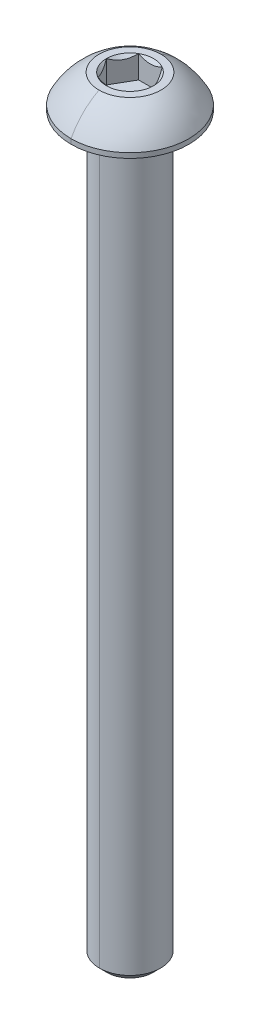
ISO-10303-21;
HEADER;
FILE_DESCRIPTION(('STEP AP214'),'2;1');
FILE_NAME('part.step','',(''),(''),'','','');
FILE_SCHEMA(('AUTOMOTIVE_DESIGN { 1 0 10303 214 1 1 1 1 }'));
ENDSEC;
DATA;
#1=APPLICATION_CONTEXT('core data for automotive mechanical design processes');
#2=APPLICATION_PROTOCOL_DEFINITION('international standard','automotive_design',2000,#1);
#3=PRODUCT_CONTEXT('',#1,'mechanical');
#4=PRODUCT('Part','Part','',(#3));
#5=PRODUCT_RELATED_PRODUCT_CATEGORY('part','',(#4));
#6=PRODUCT_DEFINITION_FORMATION('','',#4);
#7=PRODUCT_DEFINITION_CONTEXT('part definition',#1,'design');
#8=PRODUCT_DEFINITION('design','',#6,#7);
#9=PRODUCT_DEFINITION_SHAPE('','',#8);
#10=(LENGTH_UNIT() NAMED_UNIT(*) SI_UNIT(.MILLI.,.METRE.));
#11=(NAMED_UNIT(*) PLANE_ANGLE_UNIT() SI_UNIT($,.RADIAN.));
#12=(NAMED_UNIT(*) SI_UNIT($,.STERADIAN.) SOLID_ANGLE_UNIT());
#13=UNCERTAINTY_MEASURE_WITH_UNIT(LENGTH_MEASURE(1.E-05),#10,'distance_accuracy_value','');
#14=(GEOMETRIC_REPRESENTATION_CONTEXT(3) GLOBAL_UNCERTAINTY_ASSIGNED_CONTEXT((#13)) GLOBAL_UNIT_ASSIGNED_CONTEXT((#10,
#11,#12)) REPRESENTATION_CONTEXT('',''));
#15=CARTESIAN_POINT('',(0.,0.,0.));
#16=DIRECTION('',(0.,0.,1.));
#17=DIRECTION('',(1.,0.,0.));
#18=AXIS2_PLACEMENT_3D('',#15,#16,#17);
#19=CARTESIAN_POINT('',(0.,-0.152399999999997,0.));
#20=DIRECTION('',(0.,1.,0.));
#21=DIRECTION('',(0.,0.,1.));
#22=AXIS2_PLACEMENT_3D('',#19,#20,#21);
#23=TOROIDAL_SURFACE('',#22,2.5273,0.1524);
#24=CARTESIAN_POINT('',(0.,-0.152399999999997,-2.5273));
#25=DIRECTION('',(1.,0.,0.));
#26=DIRECTION('',(0.,0.,-1.));
#27=AXIS2_PLACEMENT_3D('',#24,#25,#26);
#28=CIRCLE('',#27,0.1524);
#29=CARTESIAN_POINT('',(0.,0.,-2.5273));
#30=VERTEX_POINT('',#29);
#31=CARTESIAN_POINT('',(0.,-0.152399999999997,-2.3749));
#32=VERTEX_POINT('',#31);
#33=EDGE_CURVE('E605',#30,#32,#28,.T.);
#34=ORIENTED_EDGE('',*,*,#33,.F.);
#35=CARTESIAN_POINT('',(0.,0.,0.));
#36=DIRECTION('',(0.,1.,0.));
#37=DIRECTION('',(0.,0.,1.));
#38=AXIS2_PLACEMENT_3D('',#35,#36,#37);
#39=CIRCLE('',#38,2.5273);
#40=CARTESIAN_POINT('',(0.,0.,2.5273));
#41=VERTEX_POINT('',#40);
#42=EDGE_CURVE('E170',#41,#30,#39,.T.);
#43=ORIENTED_EDGE('',*,*,#42,.F.);
#44=CARTESIAN_POINT('',(0.,-0.152399999999997,2.5273));
#45=DIRECTION('',(-1.,0.,0.));
#46=DIRECTION('',(0.,0.,1.));
#47=AXIS2_PLACEMENT_3D('',#44,#45,#46);
#48=CIRCLE('',#47,0.1524);
#49=CARTESIAN_POINT('',(0.,-0.152399999999997,2.3749));
#50=VERTEX_POINT('',#49);
#51=EDGE_CURVE('E558',#41,#50,#48,.T.);
#52=ORIENTED_EDGE('',*,*,#51,.T.);
#53=CARTESIAN_POINT('',(0.,-0.152399999999997,0.));
#54=DIRECTION('',(0.,-1.,0.));
#55=DIRECTION('',(0.,0.,1.));
#56=AXIS2_PLACEMENT_3D('',#53,#54,#55);
#57=CIRCLE('',#56,2.3749);
#58=EDGE_CURVE('E581',#32,#50,#57,.T.);
#59=ORIENTED_EDGE('',*,*,#58,.F.);
#60=EDGE_LOOP('',(#34,#43,#52,#59));
#61=FACE_BOUND('',#60,.T.);
#62=ADVANCED_FACE('F16',(#61),#23,.F.);
#63=CARTESIAN_POINT('',(0.,2.5654,0.));
#64=DIRECTION('',(0.,1.,0.));
#65=DIRECTION('',(0.,0.,1.));
#66=AXIS2_PLACEMENT_3D('',#63,#64,#65);
#67=CONICAL_SURFACE('',#66,1.83308710467706,0.78539816339745);
#68=DIRECTION('',(0.,0.707106781186546,-0.707106781186549));
#69=VECTOR('',#68,1.);
#70=CARTESIAN_POINT('',(0.,2.5654,-1.83308710467706));
#71=LINE('',#70,#69);
#72=CARTESIAN_POINT('',(0.,0.732312895322944,0.));
#73=VERTEX_POINT('',#72);
#74=CARTESIAN_POINT('',(0.,0.7874,-0.0550871046770556));
#75=VERTEX_POINT('',#74);
#76=EDGE_CURVE('E198',#73,#75,#71,.T.);
#77=ORIENTED_EDGE('',*,*,#76,.F.);
#78=DIRECTION('',(0.,0.707106781186546,0.707106781186549));
#79=VECTOR('',#78,1.);
#80=CARTESIAN_POINT('',(0.,2.5654,1.83308710467706));
#81=LINE('',#80,#79);
#82=CARTESIAN_POINT('',(0.,0.7874,0.0550871046770556));
#83=VERTEX_POINT('',#82);
#84=EDGE_CURVE('E203',#73,#83,#81,.T.);
#85=ORIENTED_EDGE('',*,*,#84,.T.);
#86=CARTESIAN_POINT('',(0.,0.7874,0.));
#87=DIRECTION('',(0.,1.,0.));
#88=DIRECTION('',(0.,0.,1.));
#89=AXIS2_PLACEMENT_3D('',#86,#87,#88);
#90=CIRCLE('',#89,0.0550871046770558);
#91=EDGE_CURVE('E509',#83,#75,#90,.T.);
#92=ORIENTED_EDGE('',*,*,#91,.T.);
#93=EDGE_LOOP('',(#77,#85,#92));
#94=FACE_BOUND('',#93,.T.);
#95=ADVANCED_FACE('F236',(#94),#67,.F.);
#96=CARTESIAN_POINT('',(1.83308710467706,0.7874,0.));
#97=DIRECTION('',(0.866025403784439,0.,-0.5));
#98=DIRECTION('',(0.,-1.,0.));
#99=AXIS2_PLACEMENT_3D('',#96,#97,#98);
#100=PLANE('',#99);
#101=DIRECTION('',(0.,1.,0.));
#102=VECTOR('',#101,1.);
#103=CARTESIAN_POINT('',(1.83308710467706,0.7874,0.));
#104=LINE('',#103,#102);
#105=CARTESIAN_POINT('',(1.83308710467706,0.7874,0.));
#106=VERTEX_POINT('',#105);
#107=CARTESIAN_POINT('',(1.83308710467706,2.5654,0.));
#108=VERTEX_POINT('',#107);
#109=EDGE_CURVE('E11',#106,#108,#104,.T.);
#110=ORIENTED_EDGE('',*,*,#109,.T.);
#111=CARTESIAN_POINT('',(1.83308710467706,2.5654,0.));
#112=CARTESIAN_POINT('',(1.58854939316106,2.32086228848399,-0.423551740712339));
#113=CARTESIAN_POINT('',(1.37650342717985,2.31981648546325,-0.790826127331817));
#114=CARTESIAN_POINT('',(1.16317917435944,2.31876437797812,-1.16031457170343));
#115=CARTESIAN_POINT('',(0.91654355233853,2.5654,-1.5875));
#116=B_SPLINE_CURVE_WITH_KNOTS('',2,(#111,#112,#113,#114,#115),.UNSPECIFIED.,.F.,.F.,(3,2,3),
(0.,0.5,1.),.UNSPECIFIED.);
#117=CARTESIAN_POINT('',(0.916543552338531,2.5654,-1.5875));
#118=VERTEX_POINT('',#117);
#119=EDGE_CURVE('E218',#108,#118,#116,.T.);
#120=ORIENTED_EDGE('',*,*,#119,.T.);
#121=DIRECTION('',(0.,1.,0.));
#122=VECTOR('',#121,1.);
#123=CARTESIAN_POINT('',(0.916543552338531,0.7874,-1.5875));
#124=LINE('',#123,#122);
#125=CARTESIAN_POINT('',(0.916543552338531,0.7874,-1.5875));
#126=VERTEX_POINT('',#125);
#127=EDGE_CURVE('E456',#126,#118,#124,.T.);
#128=ORIENTED_EDGE('',*,*,#127,.F.);
#129=DIRECTION('',(-0.5,0.,-0.866025403784439));
#130=VECTOR('',#129,1.);
#131=CARTESIAN_POINT('',(1.83308710467706,0.7874,0.));
#132=LINE('',#131,#130);
#133=EDGE_CURVE('E515',#106,#126,#132,.T.);
#134=ORIENTED_EDGE('',*,*,#133,.F.);
#135=EDGE_LOOP('',(#110,#120,#128,#134));
#136=FACE_BOUND('',#135,.T.);
#137=ADVANCED_FACE('F225',(#136),#100,.F.);
#138=CARTESIAN_POINT('',(0.916543552338531,0.7874,1.5875));
#139=DIRECTION('',(0.866025403784439,0.,0.5));
#140=DIRECTION('',(0.,-1.,0.));
#141=AXIS2_PLACEMENT_3D('',#138,#139,#140);
#142=PLANE('',#141);
#143=DIRECTION('',(0.,1.,0.));
#144=VECTOR('',#143,1.);
#145=CARTESIAN_POINT('',(0.916543552338531,0.7874,1.5875));
#146=LINE('',#145,#144);
#147=CARTESIAN_POINT('',(0.916543552338531,0.7874,1.5875));
#148=VERTEX_POINT('',#147);
#149=CARTESIAN_POINT('',(0.916543552338531,2.5654,1.5875));
#150=VERTEX_POINT('',#149);
#151=EDGE_CURVE('E29',#148,#150,#146,.T.);
#152=ORIENTED_EDGE('',*,*,#151,.T.);
#153=CARTESIAN_POINT('',(0.916543552338531,2.5654,1.5875));
#154=CARTESIAN_POINT('',(1.16108126385472,2.32086228848382,1.16394825928734));
#155=CARTESIAN_POINT('',(1.37312722983574,2.31981648546325,0.796673872668184));
#156=CARTESIAN_POINT('',(1.58645148265633,2.3187643779783,0.427185428296259));
#157=CARTESIAN_POINT('',(1.83308710467706,2.5654,0.));
#158=B_SPLINE_CURVE_WITH_KNOTS('',2,(#153,#154,#155,#156,#157),.UNSPECIFIED.,.F.,.F.,(3,2,3),
(0.,0.5,1.),.UNSPECIFIED.);
#159=EDGE_CURVE('E362',#150,#108,#158,.T.);
#160=ORIENTED_EDGE('',*,*,#159,.T.);
#161=ORIENTED_EDGE('',*,*,#109,.F.);
#162=DIRECTION('',(0.5,0.,-0.866025403784439));
#163=VECTOR('',#162,1.);
#164=CARTESIAN_POINT('',(0.916543552338531,0.7874,1.5875));
#165=LINE('',#164,#163);
#166=EDGE_CURVE('E520',#148,#106,#165,.T.);
#167=ORIENTED_EDGE('',*,*,#166,.F.);
#168=EDGE_LOOP('',(#152,#160,#161,#167));
#169=FACE_BOUND('',#168,.T.);
#170=ADVANCED_FACE('F235',(#169),#142,.F.);
#171=CARTESIAN_POINT('',(-0.91654355233853,0.7874,1.5875));
#172=DIRECTION('',(0.,0.,1.));
#173=DIRECTION('',(1.,0.,0.));
#174=AXIS2_PLACEMENT_3D('',#171,#172,#173);
#175=PLANE('',#174);
#176=DIRECTION('',(0.,1.,0.));
#177=VECTOR('',#176,1.);
#178=CARTESIAN_POINT('',(-0.91654355233853,0.7874,1.5875));
#179=LINE('',#178,#177);
#180=CARTESIAN_POINT('',(-0.91654355233853,0.7874,1.5875));
#181=VERTEX_POINT('',#180);
#182=CARTESIAN_POINT('',(-0.91654355233853,2.5654,1.5875));
#183=VERTEX_POINT('',#182);
#184=EDGE_CURVE('E303',#181,#183,#179,.T.);
#185=ORIENTED_EDGE('',*,*,#184,.T.);
#186=CARTESIAN_POINT('',(-0.916543552338531,2.5654,1.5875));
#187=CARTESIAN_POINT('',(-0.684381010738564,2.44931872920002,1.5875));
#188=CARTESIAN_POINT('',(-0.4718738638875,2.38845938444161,1.5875));
#189=CARTESIAN_POINT('',(-0.232175759974894,2.31981289532294,1.5875));
#190=CARTESIAN_POINT('',(0.,2.31981289532294,1.5875));
#191=B_SPLINE_CURVE_WITH_KNOTS('',2,(#186,#187,#188,#189,#190),.UNSPECIFIED.,.F.,.F.,(3,2,3),
(0.,0.5,1.),.UNSPECIFIED.);
#192=CARTESIAN_POINT('',(0.,2.31981289532294,1.5875));
#193=VERTEX_POINT('',#192);
#194=EDGE_CURVE('E297',#183,#193,#191,.T.);
#195=ORIENTED_EDGE('',*,*,#194,.T.);
#196=CARTESIAN_POINT('',(0.,2.31981289532294,1.5875));
#197=CARTESIAN_POINT('',(0.229732695645398,2.31981289532294,1.5875));
#198=CARTESIAN_POINT('',(0.471961624215038,2.3884843914945,1.5875));
#199=CARTESIAN_POINT('',(0.68154594324368,2.44790119545257,1.5875));
#200=CARTESIAN_POINT('',(0.91654355233853,2.5654,1.5875));
#201=B_SPLINE_CURVE_WITH_KNOTS('',2,(#196,#197,#198,#199,#200),.UNSPECIFIED.,.F.,.F.,(3,2,3),
(0.,0.5,1.),.UNSPECIFIED.);
#202=EDGE_CURVE('E263',#193,#150,#201,.T.);
#203=ORIENTED_EDGE('',*,*,#202,.T.);
#204=ORIENTED_EDGE('',*,*,#151,.F.);
#205=DIRECTION('',(1.,0.,0.));
#206=VECTOR('',#205,1.);
#207=CARTESIAN_POINT('',(-0.91654355233853,0.7874,1.5875));
#208=LINE('',#207,#206);
#209=EDGE_CURVE('E544',#181,#148,#208,.T.);
#210=ORIENTED_EDGE('',*,*,#209,.F.);
#211=EDGE_LOOP('',(#185,#195,#203,#204,#210));
#212=FACE_BOUND('',#211,.T.);
#213=ADVANCED_FACE('F267',(#212),#175,.F.);
#214=CARTESIAN_POINT('',(-1.83308710467706,0.7874,0.));
#215=DIRECTION('',(-0.866025403784439,0.,0.5));
#216=DIRECTION('',(0.,1.,0.));
#217=AXIS2_PLACEMENT_3D('',#214,#215,#216);
#218=PLANE('',#217);
#219=DIRECTION('',(0.,1.,0.));
#220=VECTOR('',#219,1.);
#221=CARTESIAN_POINT('',(-1.83308710467706,0.7874,0.));
#222=LINE('',#221,#220);
#223=CARTESIAN_POINT('',(-1.83308710467706,0.7874,0.));
#224=VERTEX_POINT('',#223);
#225=CARTESIAN_POINT('',(-1.83308710467706,2.5654,0.));
#226=VERTEX_POINT('',#225);
#227=EDGE_CURVE('E455',#224,#226,#222,.T.);
#228=ORIENTED_EDGE('',*,*,#227,.T.);
#229=CARTESIAN_POINT('',(-1.83308710467706,2.5654,0.));
#230=CARTESIAN_POINT('',(-1.58854939316106,2.32086228848399,0.423551740712331));
#231=CARTESIAN_POINT('',(-1.37650342717985,2.31981648546325,0.790826127331817));
#232=CARTESIAN_POINT('',(-1.16317917435944,2.31876437797812,1.16031457170343));
#233=CARTESIAN_POINT('',(-0.91654355233853,2.5654,1.5875));
#234=B_SPLINE_CURVE_WITH_KNOTS('',2,(#229,#230,#231,#232,#233),.UNSPECIFIED.,.F.,.F.,(3,2,3),
(0.,0.5,1.),.UNSPECIFIED.);
#235=EDGE_CURVE('E404',#226,#183,#234,.T.);
#236=ORIENTED_EDGE('',*,*,#235,.T.);
#237=ORIENTED_EDGE('',*,*,#184,.F.);
#238=DIRECTION('',(0.5,0.,0.866025403784438));
#239=VECTOR('',#238,1.);
#240=CARTESIAN_POINT('',(-1.83308710467706,0.7874,0.));
#241=LINE('',#240,#239);
#242=EDGE_CURVE('E542',#224,#181,#241,.T.);
#243=ORIENTED_EDGE('',*,*,#242,.F.);
#244=EDGE_LOOP('',(#228,#236,#237,#243));
#245=FACE_BOUND('',#244,.T.);
#246=ADVANCED_FACE('F277',(#245),#218,.F.);
#247=CARTESIAN_POINT('',(-0.916543552338531,0.7874,-1.5875));
#248=DIRECTION('',(-0.866025403784439,0.,-0.5));
#249=DIRECTION('',(-0.5,0.,0.866025403784439));
#250=AXIS2_PLACEMENT_3D('',#247,#248,#249);
#251=PLANE('',#250);
#252=DIRECTION('',(0.,1.,0.));
#253=VECTOR('',#252,1.);
#254=CARTESIAN_POINT('',(-0.916543552338531,0.7874,-1.5875));
#255=LINE('',#254,#253);
#256=CARTESIAN_POINT('',(-0.916543552338531,0.7874,-1.5875));
#257=VERTEX_POINT('',#256);
#258=CARTESIAN_POINT('',(-0.916543552338531,2.5654,-1.5875));
#259=VERTEX_POINT('',#258);
#260=EDGE_CURVE('E452',#257,#259,#255,.T.);
#261=ORIENTED_EDGE('',*,*,#260,.T.);
#262=CARTESIAN_POINT('',(-0.916543552338531,2.5654,-1.5875));
#263=CARTESIAN_POINT('',(-1.16108126385453,2.320862288484,-1.16394825928767));
#264=CARTESIAN_POINT('',(-1.37312722983574,2.31981648546325,-0.796673872668183));
#265=CARTESIAN_POINT('',(-1.58645148265615,2.31876437797813,-0.427185428296571));
#266=CARTESIAN_POINT('',(-1.83308710467706,2.5654,0.));
#267=B_SPLINE_CURVE_WITH_KNOTS('',2,(#262,#263,#264,#265,#266),.UNSPECIFIED.,.F.,.F.,(3,2,3),
(0.,0.5,1.),.UNSPECIFIED.);
#268=EDGE_CURVE('E470',#259,#226,#267,.T.);
#269=ORIENTED_EDGE('',*,*,#268,.T.);
#270=ORIENTED_EDGE('',*,*,#227,.F.);
#271=DIRECTION('',(-0.5,0.,0.866025403784439));
#272=VECTOR('',#271,1.);
#273=CARTESIAN_POINT('',(-0.916543552338531,0.7874,-1.5875));
#274=LINE('',#273,#272);
#275=EDGE_CURVE('E527',#257,#224,#274,.T.);
#276=ORIENTED_EDGE('',*,*,#275,.F.);
#277=EDGE_LOOP('',(#261,#269,#270,#276));
#278=FACE_BOUND('',#277,.T.);
#279=ADVANCED_FACE('F343',(#278),#251,.F.);
#280=CARTESIAN_POINT('',(0.916543552338531,0.7874,-1.5875));
#281=DIRECTION('',(0.,0.,-1.));
#282=DIRECTION('',(-1.,0.,0.));
#283=AXIS2_PLACEMENT_3D('',#280,#281,#282);
#284=PLANE('',#283);
#285=ORIENTED_EDGE('',*,*,#127,.T.);
#286=CARTESIAN_POINT('',(0.916543552338531,2.5654,-1.5875));
#287=CARTESIAN_POINT('',(0.68330023814449,2.44877834290298,-1.5875));
#288=CARTESIAN_POINT('',(0.472022049766507,2.38850161206546,-1.5875));
#289=CARTESIAN_POINT('',(0.231606862063275,2.31991222444484,-1.5875));
#290=CARTESIAN_POINT('',(0.000126990617285933,2.31981290040219,-1.5875));
#291=CARTESIAN_POINT('',(-0.230319895797069,2.3197140195957,-1.5875));
#292=CARTESIAN_POINT('',(-0.471813597713689,2.38844221424328,-1.5875));
#293=CARTESIAN_POINT('',(-0.682613944360854,2.44843519601116,-1.5875));
#294=CARTESIAN_POINT('',(-0.916543552338529,2.5654,-1.5875));
#295=B_SPLINE_CURVE_WITH_KNOTS('',2,(#286,#287,#288,#289,#290,#291,#292,#293,#294),
.UNSPECIFIED.,.F.,.F.,(3,2,2,2,3),(0.,0.25,0.5,0.75,1.),.UNSPECIFIED.);
#296=EDGE_CURVE('E448',#118,#259,#295,.T.);
#297=ORIENTED_EDGE('',*,*,#296,.T.);
#298=ORIENTED_EDGE('',*,*,#260,.F.);
#299=DIRECTION('',(-1.,0.,0.));
#300=VECTOR('',#299,1.);
#301=CARTESIAN_POINT('',(0.916543552338531,0.7874,-1.5875));
#302=LINE('',#301,#300);
#303=EDGE_CURVE('E518',#126,#257,#302,.T.);
#304=ORIENTED_EDGE('',*,*,#303,.F.);
#305=EDGE_LOOP('',(#285,#297,#298,#304));
#306=FACE_BOUND('',#305,.T.);
#307=ADVANCED_FACE('F432',(#306),#284,.F.);
#308=CARTESIAN_POINT('',(0.,0.7874,0.));
#309=DIRECTION('',(0.,1.,0.));
#310=DIRECTION('',(1.,0.,0.));
#311=AXIS2_PLACEMENT_3D('',#308,#309,#310);
#312=PLANE('',#311);
#313=ORIENTED_EDGE('',*,*,#91,.F.);
#314=CARTESIAN_POINT('',(0.,0.7874,0.));
#315=DIRECTION('',(0.,1.,0.));
#316=DIRECTION('',(0.,0.,1.));
#317=AXIS2_PLACEMENT_3D('',#314,#315,#316);
#318=CIRCLE('',#317,0.0550871046770558);
#319=EDGE_CURVE('E202',#75,#83,#318,.T.);
#320=ORIENTED_EDGE('',*,*,#319,.F.);
#321=EDGE_LOOP('',(#313,#320));
#322=FACE_BOUND('',#321,.T.);
#323=ORIENTED_EDGE('',*,*,#133,.T.);
#324=ORIENTED_EDGE('',*,*,#303,.T.);
#325=ORIENTED_EDGE('',*,*,#275,.T.);
#326=ORIENTED_EDGE('',*,*,#242,.T.);
#327=ORIENTED_EDGE('',*,*,#209,.T.);
#328=ORIENTED_EDGE('',*,*,#166,.T.);
#329=EDGE_LOOP('',(#323,#324,#325,#326,#327,#328));
#330=FACE_BOUND('',#329,.T.);
#331=ADVANCED_FACE('F436',(#322,#330),#312,.T.);
#332=CARTESIAN_POINT('',(0.,2.5654,0.));
#333=DIRECTION('',(0.,1.,0.));
#334=DIRECTION('',(0.,0.,1.));
#335=AXIS2_PLACEMENT_3D('',#332,#333,#334);
#336=CONICAL_SURFACE('',#335,1.83308710467706,0.78539816339745);
#337=CARTESIAN_POINT('',(0.,2.5654,0.));
#338=DIRECTION('',(0.,1.,0.));
#339=DIRECTION('',(0.,0.,1.));
#340=AXIS2_PLACEMENT_3D('',#337,#338,#339);
#341=CIRCLE('',#340,1.83308710467706);
#342=EDGE_CURVE('E802',#108,#118,#341,.T.);
#343=ORIENTED_EDGE('',*,*,#342,.T.);
#344=ORIENTED_EDGE('',*,*,#119,.F.);
#345=EDGE_LOOP('',(#343,#344));
#346=FACE_BOUND('',#345,.T.);
#347=ADVANCED_FACE('F237',(#346),#336,.F.);
#348=CARTESIAN_POINT('',(0.,2.5654,0.));
#349=DIRECTION('',(0.,1.,0.));
#350=DIRECTION('',(0.,0.,1.));
#351=AXIS2_PLACEMENT_3D('',#348,#349,#350);
#352=CONICAL_SURFACE('',#351,1.83308710467706,0.78539816339745);
#353=CARTESIAN_POINT('',(0.,2.5654,0.));
#354=DIRECTION('',(0.,1.,0.));
#355=DIRECTION('',(0.,0.,1.));
#356=AXIS2_PLACEMENT_3D('',#353,#354,#355);
#357=CIRCLE('',#356,1.83308710467706);
#358=EDGE_CURVE('E767',#150,#108,#357,.T.);
#359=ORIENTED_EDGE('',*,*,#358,.T.);
#360=ORIENTED_EDGE('',*,*,#159,.F.);
#361=EDGE_LOOP('',(#359,#360));
#362=FACE_BOUND('',#361,.T.);
#363=ADVANCED_FACE('F247',(#362),#352,.F.);
#364=CARTESIAN_POINT('',(0.,2.5654,0.));
#365=DIRECTION('',(0.,1.,0.));
#366=DIRECTION('',(0.,0.,1.));
#367=AXIS2_PLACEMENT_3D('',#364,#365,#366);
#368=CONICAL_SURFACE('',#367,1.83308710467706,0.78539816339745);
#369=DIRECTION('',(0.,0.707106781186546,0.707106781186549));
#370=VECTOR('',#369,1.);
#371=CARTESIAN_POINT('',(0.,2.5654,1.83308710467706));
#372=LINE('',#371,#370);
#373=CARTESIAN_POINT('',(0.,2.5654,1.83308710467706));
#374=VERTEX_POINT('',#373);
#375=EDGE_CURVE('E380',#193,#374,#372,.T.);
#376=ORIENTED_EDGE('',*,*,#375,.F.);
#377=ORIENTED_EDGE('',*,*,#194,.F.);
#378=CARTESIAN_POINT('',(0.,2.5654,0.));
#379=DIRECTION('',(0.,1.,0.));
#380=DIRECTION('',(0.,0.,1.));
#381=AXIS2_PLACEMENT_3D('',#378,#379,#380);
#382=CIRCLE('',#381,1.83308710467706);
#383=EDGE_CURVE('E692',#183,#374,#382,.T.);
#384=ORIENTED_EDGE('',*,*,#383,.T.);
#385=EDGE_LOOP('',(#376,#377,#384));
#386=FACE_BOUND('',#385,.T.);
#387=ADVANCED_FACE('F305',(#386),#368,.F.);
#388=CARTESIAN_POINT('',(0.,2.5654,0.));
#389=DIRECTION('',(0.,1.,0.));
#390=DIRECTION('',(0.,0.,1.));
#391=AXIS2_PLACEMENT_3D('',#388,#389,#390);
#392=CONICAL_SURFACE('',#391,1.83308710467706,0.78539816339745);
#393=CARTESIAN_POINT('',(0.,2.5654,0.));
#394=DIRECTION('',(0.,1.,0.));
#395=DIRECTION('',(0.,0.,1.));
#396=AXIS2_PLACEMENT_3D('',#393,#394,#395);
#397=CIRCLE('',#396,1.83308710467706);
#398=EDGE_CURVE('E486',#226,#183,#397,.T.);
#399=ORIENTED_EDGE('',*,*,#398,.T.);
#400=ORIENTED_EDGE('',*,*,#235,.F.);
#401=EDGE_LOOP('',(#399,#400));
#402=FACE_BOUND('',#401,.T.);
#403=ADVANCED_FACE('F314',(#402),#392,.F.);
#404=CARTESIAN_POINT('',(0.,2.5654,0.));
#405=DIRECTION('',(0.,1.,0.));
#406=DIRECTION('',(0.,0.,1.));
#407=AXIS2_PLACEMENT_3D('',#404,#405,#406);
#408=CONICAL_SURFACE('',#407,1.83308710467706,0.78539816339745);
#409=CARTESIAN_POINT('',(0.,2.5654,0.));
#410=DIRECTION('',(0.,1.,0.));
#411=DIRECTION('',(0.,0.,1.));
#412=AXIS2_PLACEMENT_3D('',#409,#410,#411);
#413=CIRCLE('',#412,1.83308710467706);
#414=EDGE_CURVE('E483',#259,#226,#413,.T.);
#415=ORIENTED_EDGE('',*,*,#414,.T.);
#416=ORIENTED_EDGE('',*,*,#268,.F.);
#417=EDGE_LOOP('',(#415,#416));
#418=FACE_BOUND('',#417,.T.);
#419=ADVANCED_FACE('F245',(#418),#408,.F.);
#420=CARTESIAN_POINT('',(0.,2.5654,0.));
#421=DIRECTION('',(0.,1.,0.));
#422=DIRECTION('',(0.,0.,1.));
#423=AXIS2_PLACEMENT_3D('',#420,#421,#422);
#424=CONICAL_SURFACE('',#423,1.83308710467706,0.78539816339745);
#425=CARTESIAN_POINT('',(0.,2.5654,0.));
#426=DIRECTION('',(0.,1.,0.));
#427=DIRECTION('',(0.,0.,1.));
#428=AXIS2_PLACEMENT_3D('',#425,#426,#427);
#429=CIRCLE('',#428,1.83308710467706);
#430=EDGE_CURVE('E535',#118,#259,#429,.T.);
#431=ORIENTED_EDGE('',*,*,#430,.T.);
#432=ORIENTED_EDGE('',*,*,#296,.F.);
#433=EDGE_LOOP('',(#431,#432));
#434=FACE_BOUND('',#433,.T.);
#435=ADVANCED_FACE('F240',(#434),#424,.F.);
#436=CARTESIAN_POINT('',(0.,2.5654,-2.413));
#437=DIRECTION('',(0.,-1.,0.));
#438=DIRECTION('',(0.,0.,-1.));
#439=AXIS2_PLACEMENT_3D('',#436,#437,#438);
#440=PLANE('',#439);
#441=ORIENTED_EDGE('',*,*,#430,.F.);
#442=ORIENTED_EDGE('',*,*,#342,.F.);
#443=ORIENTED_EDGE('',*,*,#358,.F.);
#444=CARTESIAN_POINT('',(0.,2.5654,0.));
#445=DIRECTION('',(0.,1.,0.));
#446=DIRECTION('',(0.,0.,1.));
#447=AXIS2_PLACEMENT_3D('',#444,#445,#446);
#448=CIRCLE('',#447,1.83308710467706);
#449=EDGE_CURVE('E376',#374,#150,#448,.T.);
#450=ORIENTED_EDGE('',*,*,#449,.F.);
#451=ORIENTED_EDGE('',*,*,#383,.F.);
#452=ORIENTED_EDGE('',*,*,#398,.F.);
#453=ORIENTED_EDGE('',*,*,#414,.F.);
#454=EDGE_LOOP('',(#441,#442,#443,#450,#451,#452,#453));
#455=FACE_BOUND('',#454,.T.);
#456=CARTESIAN_POINT('',(0.,2.5654,0.));
#457=DIRECTION('',(0.,1.,0.));
#458=DIRECTION('',(0.,0.,1.));
#459=AXIS2_PLACEMENT_3D('',#456,#457,#458);
#460=CIRCLE('',#459,2.413);
#461=CARTESIAN_POINT('',(0.,2.5654,2.413));
#462=VERTEX_POINT('',#461);
#463=CARTESIAN_POINT('',(0.,2.5654,-2.413));
#464=VERTEX_POINT('',#463);
#465=EDGE_CURVE('E192',#462,#464,#460,.T.);
#466=ORIENTED_EDGE('',*,*,#465,.T.);
#467=CARTESIAN_POINT('',(0.,2.5654,0.));
#468=DIRECTION('',(0.,1.,0.));
#469=DIRECTION('',(0.,0.,1.));
#470=AXIS2_PLACEMENT_3D('',#467,#468,#469);
#471=CIRCLE('',#470,2.413);
#472=EDGE_CURVE('E532',#464,#462,#471,.T.);
#473=ORIENTED_EDGE('',*,*,#472,.T.);
#474=EDGE_LOOP('',(#466,#473));
#475=FACE_BOUND('',#474,.T.);
#476=ADVANCED_FACE('F244',(#455,#475),#440,.F.);
#477=CARTESIAN_POINT('',(0.,-1.9398474797777,0.));
#478=DIRECTION('',(0.,1.,0.));
#479=DIRECTION('',(0.,0.,1.));
#480=AXIS2_PLACEMENT_3D('',#477,#478,#479);
#481=DEGENERATE_TOROIDAL_SURFACE('',#480,0.065843178235288,5.08,.T.);
#482=CARTESIAN_POINT('',(0.,-1.9398474797777,-0.065843178235288));
#483=DIRECTION('',(1.,0.,0.));
#484=DIRECTION('',(0.,0.,-1.));
#485=AXIS2_PLACEMENT_3D('',#482,#483,#484);
#486=CIRCLE('',#485,5.08);
#487=CARTESIAN_POINT('',(0.,0.381,-4.5847));
#488=VERTEX_POINT('',#487);
#489=EDGE_CURVE('E207',#488,#464,#486,.T.);
#490=ORIENTED_EDGE('',*,*,#489,.F.);
#491=CARTESIAN_POINT('',(0.,0.381,0.));
#492=DIRECTION('',(0.,1.,0.));
#493=DIRECTION('',(0.,0.,1.));
#494=AXIS2_PLACEMENT_3D('',#491,#492,#493);
#495=CIRCLE('',#494,4.5847);
#496=CARTESIAN_POINT('',(0.,0.381,4.5847));
#497=VERTEX_POINT('',#496);
#498=EDGE_CURVE('E176',#488,#497,#495,.T.);
#499=ORIENTED_EDGE('',*,*,#498,.T.);
#500=CARTESIAN_POINT('',(0.,-1.9398474797777,0.065843178235288));
#501=DIRECTION('',(-1.,0.,0.));
#502=DIRECTION('',(0.,0.,1.));
#503=AXIS2_PLACEMENT_3D('',#500,#501,#502);
#504=CIRCLE('',#503,5.08);
#505=EDGE_CURVE('E185',#497,#462,#504,.T.);
#506=ORIENTED_EDGE('',*,*,#505,.T.);
#507=ORIENTED_EDGE('',*,*,#472,.F.);
#508=EDGE_LOOP('',(#490,#499,#506,#507));
#509=FACE_BOUND('',#508,.T.);
#510=ADVANCED_FACE('F317',(#509),#481,.T.);
#511=CARTESIAN_POINT('',(0.,2.5654,0.));
#512=DIRECTION('',(0.,1.,0.));
#513=DIRECTION('',(0.,0.,1.));
#514=AXIS2_PLACEMENT_3D('',#511,#512,#513);
#515=CYLINDRICAL_SURFACE('',#514,4.5847);
#516=DIRECTION('',(0.,1.,0.));
#517=VECTOR('',#516,1.);
#518=CARTESIAN_POINT('',(0.,2.5654,-4.5847));
#519=LINE('',#518,#517);
#520=CARTESIAN_POINT('',(0.,0.,-4.5847));
#521=VERTEX_POINT('',#520);
#522=EDGE_CURVE('E174',#521,#488,#519,.T.);
#523=ORIENTED_EDGE('',*,*,#522,.F.);
#524=CARTESIAN_POINT('',(0.,0.,0.));
#525=DIRECTION('',(0.,1.,0.));
#526=DIRECTION('',(0.,0.,1.));
#527=AXIS2_PLACEMENT_3D('',#524,#525,#526);
#528=CIRCLE('',#527,4.5847);
#529=CARTESIAN_POINT('',(0.,0.,4.5847));
#530=VERTEX_POINT('',#529);
#531=EDGE_CURVE('E161',#521,#530,#528,.T.);
#532=ORIENTED_EDGE('',*,*,#531,.T.);
#533=DIRECTION('',(0.,1.,0.));
#534=VECTOR('',#533,1.);
#535=CARTESIAN_POINT('',(0.,2.5654,4.5847));
#536=LINE('',#535,#534);
#537=EDGE_CURVE('E181',#530,#497,#536,.T.);
#538=ORIENTED_EDGE('',*,*,#537,.T.);
#539=ORIENTED_EDGE('',*,*,#498,.F.);
#540=EDGE_LOOP('',(#523,#532,#538,#539));
#541=FACE_BOUND('',#540,.T.);
#542=ADVANCED_FACE('F175',(#541),#515,.T.);
#543=CARTESIAN_POINT('',(0.,0.,0.));
#544=DIRECTION('',(0.,1.,0.));
#545=DIRECTION('',(1.,0.,0.));
#546=AXIS2_PLACEMENT_3D('',#543,#544,#545);
#547=PLANE('',#546);
#548=ORIENTED_EDGE('',*,*,#42,.T.);
#549=CARTESIAN_POINT('',(0.,0.,0.));
#550=DIRECTION('',(0.,1.,0.));
#551=DIRECTION('',(0.,0.,1.));
#552=AXIS2_PLACEMENT_3D('',#549,#550,#551);
#553=CIRCLE('',#552,2.5273);
#554=EDGE_CURVE('E196',#30,#41,#553,.T.);
#555=ORIENTED_EDGE('',*,*,#554,.T.);
#556=EDGE_LOOP('',(#548,#555));
#557=FACE_BOUND('',#556,.T.);
#558=CARTESIAN_POINT('',(0.,0.,0.));
#559=DIRECTION('',(0.,1.,0.));
#560=DIRECTION('',(0.,0.,1.));
#561=AXIS2_PLACEMENT_3D('',#558,#559,#560);
#562=CIRCLE('',#561,4.5847);
#563=EDGE_CURVE('E165',#530,#521,#562,.T.);
#564=ORIENTED_EDGE('',*,*,#563,.F.);
#565=ORIENTED_EDGE('',*,*,#531,.F.);
#566=EDGE_LOOP('',(#564,#565));
#567=FACE_BOUND('',#566,.T.);
#568=ADVANCED_FACE('F163',(#557,#567),#547,.F.);
#569=CARTESIAN_POINT('',(0.,-56.5658,0.));
#570=DIRECTION('',(0.,1.,0.));
#571=DIRECTION('',(0.,0.,1.));
#572=AXIS2_PLACEMENT_3D('',#569,#570,#571);
#573=CONICAL_SURFACE('',#572,2.3749,0.785398163397449);
#574=DIRECTION('',(0.,0.707106781186547,-0.707106781186548));
#575=VECTOR('',#574,1.);
#576=CARTESIAN_POINT('',(0.,-56.5658,-2.3749));
#577=LINE('',#576,#575);
#578=CARTESIAN_POINT('',(0.,-57.15,-1.7907));
#579=VERTEX_POINT('',#578);
#580=CARTESIAN_POINT('',(0.,-56.5658,-2.3749));
#581=VERTEX_POINT('',#580);
#582=EDGE_CURVE('E208',#579,#581,#577,.T.);
#583=ORIENTED_EDGE('',*,*,#582,.F.);
#584=CARTESIAN_POINT('',(0.,-57.15,0.));
#585=DIRECTION('',(0.,-1.,0.));
#586=DIRECTION('',(0.,0.,1.));
#587=AXIS2_PLACEMENT_3D('',#584,#585,#586);
#588=CIRCLE('',#587,1.7907);
#589=CARTESIAN_POINT('',(0.,-57.15,1.7907));
#590=VERTEX_POINT('',#589);
#591=EDGE_CURVE('E171',#590,#579,#588,.T.);
#592=ORIENTED_EDGE('',*,*,#591,.F.);
#593=DIRECTION('',(0.,0.707106781186547,0.707106781186548));
#594=VECTOR('',#593,1.);
#595=CARTESIAN_POINT('',(0.,-56.5658,2.3749));
#596=LINE('',#595,#594);
#597=CARTESIAN_POINT('',(0.,-56.5658,2.3749));
#598=VERTEX_POINT('',#597);
#599=EDGE_CURVE('E566',#590,#598,#596,.T.);
#600=ORIENTED_EDGE('',*,*,#599,.T.);
#601=CARTESIAN_POINT('',(0.,-56.5658,0.));
#602=DIRECTION('',(0.,1.,0.));
#603=DIRECTION('',(0.,0.,1.));
#604=AXIS2_PLACEMENT_3D('',#601,#602,#603);
#605=CIRCLE('',#604,2.3749);
#606=EDGE_CURVE('E540',#581,#598,#605,.T.);
#607=ORIENTED_EDGE('',*,*,#606,.F.);
#608=EDGE_LOOP('',(#583,#592,#600,#607));
#609=FACE_BOUND('',#608,.T.);
#610=ADVANCED_FACE('F323',(#609),#573,.T.);
#611=CARTESIAN_POINT('',(0.,-57.15,0.));
#612=DIRECTION('',(0.,1.,0.));
#613=DIRECTION('',(1.,0.,0.));
#614=AXIS2_PLACEMENT_3D('',#611,#612,#613);
#615=PLANE('',#614);
#616=ORIENTED_EDGE('',*,*,#591,.T.);
#617=CARTESIAN_POINT('',(0.,-57.15,0.));
#618=DIRECTION('',(0.,-1.,0.));
#619=DIRECTION('',(0.,0.,1.));
#620=AXIS2_PLACEMENT_3D('',#617,#618,#619);
#621=CIRCLE('',#620,1.7907);
#622=EDGE_CURVE('E213',#579,#590,#621,.T.);
#623=ORIENTED_EDGE('',*,*,#622,.T.);
#624=EDGE_LOOP('',(#616,#623));
#625=FACE_BOUND('',#624,.T.);
#626=ADVANCED_FACE('F423',(#625),#615,.F.);
#627=CARTESIAN_POINT('',(0.,-57.15,0.));
#628=DIRECTION('',(0.,1.,0.));
#629=DIRECTION('',(0.,0.,1.));
#630=AXIS2_PLACEMENT_3D('',#627,#628,#629);
#631=CYLINDRICAL_SURFACE('',#630,2.3749);
#632=DIRECTION('',(0.,1.,0.));
#633=VECTOR('',#632,1.);
#634=CARTESIAN_POINT('',(0.,-57.15,-2.3749));
#635=LINE('',#634,#633);
#636=EDGE_CURVE('E555',#581,#32,#635,.T.);
#637=ORIENTED_EDGE('',*,*,#636,.F.);
#638=ORIENTED_EDGE('',*,*,#606,.T.);
#639=DIRECTION('',(0.,1.,0.));
#640=VECTOR('',#639,1.);
#641=CARTESIAN_POINT('',(0.,-57.15,2.3749));
#642=LINE('',#641,#640);
#643=EDGE_CURVE('E589',#598,#50,#642,.T.);
#644=ORIENTED_EDGE('',*,*,#643,.T.);
#645=CARTESIAN_POINT('',(0.,-0.152399999999997,0.));
#646=DIRECTION('',(0.,-1.,0.));
#647=DIRECTION('',(0.,0.,1.));
#648=AXIS2_PLACEMENT_3D('',#645,#646,#647);
#649=CIRCLE('',#648,2.3749);
#650=EDGE_CURVE('E562',#50,#32,#649,.T.);
#651=ORIENTED_EDGE('',*,*,#650,.T.);
#652=EDGE_LOOP('',(#637,#638,#644,#651));
#653=FACE_BOUND('',#652,.T.);
#654=ADVANCED_FACE('F426',(#653),#631,.T.);
#655=CARTESIAN_POINT('',(0.,-57.15,0.));
#656=DIRECTION('',(0.,1.,0.));
#657=DIRECTION('',(0.,0.,1.));
#658=AXIS2_PLACEMENT_3D('',#655,#656,#657);
#659=CYLINDRICAL_SURFACE('',#658,2.3749);
#660=CARTESIAN_POINT('',(0.,-56.5658,0.));
#661=DIRECTION('',(0.,1.,0.));
#662=DIRECTION('',(0.,0.,1.));
#663=AXIS2_PLACEMENT_3D('',#660,#661,#662);
#664=CIRCLE('',#663,2.3749);
#665=EDGE_CURVE('E212',#598,#581,#664,.T.);
#666=ORIENTED_EDGE('',*,*,#665,.T.);
#667=ORIENTED_EDGE('',*,*,#636,.T.);
#668=ORIENTED_EDGE('',*,*,#58,.T.);
#669=ORIENTED_EDGE('',*,*,#643,.F.);
#670=EDGE_LOOP('',(#666,#667,#668,#669));
#671=FACE_BOUND('',#670,.T.);
#672=ADVANCED_FACE('F428',(#671),#659,.T.);
#673=CARTESIAN_POINT('',(0.,-56.5658,0.));
#674=DIRECTION('',(0.,1.,0.));
#675=DIRECTION('',(0.,0.,1.));
#676=AXIS2_PLACEMENT_3D('',#673,#674,#675);
#677=CONICAL_SURFACE('',#676,2.3749,0.785398163397449);
#678=ORIENTED_EDGE('',*,*,#622,.F.);
#679=ORIENTED_EDGE('',*,*,#582,.T.);
#680=ORIENTED_EDGE('',*,*,#665,.F.);
#681=ORIENTED_EDGE('',*,*,#599,.F.);
#682=EDGE_LOOP('',(#678,#679,#680,#681));
#683=FACE_BOUND('',#682,.T.);
#684=ADVANCED_FACE('F338',(#683),#677,.T.);
#685=CARTESIAN_POINT('',(0.,2.5654,0.));
#686=DIRECTION('',(0.,1.,0.));
#687=DIRECTION('',(0.,0.,1.));
#688=AXIS2_PLACEMENT_3D('',#685,#686,#687);
#689=CYLINDRICAL_SURFACE('',#688,4.5847);
#690=ORIENTED_EDGE('',*,*,#563,.T.);
#691=ORIENTED_EDGE('',*,*,#522,.T.);
#692=CARTESIAN_POINT('',(0.,0.381,0.));
#693=DIRECTION('',(0.,1.,0.));
#694=DIRECTION('',(0.,0.,1.));
#695=AXIS2_PLACEMENT_3D('',#692,#693,#694);
#696=CIRCLE('',#695,4.5847);
#697=EDGE_CURVE('E379',#497,#488,#696,.T.);
#698=ORIENTED_EDGE('',*,*,#697,.F.);
#699=ORIENTED_EDGE('',*,*,#537,.F.);
#700=EDGE_LOOP('',(#690,#691,#698,#699));
#701=FACE_BOUND('',#700,.T.);
#702=ADVANCED_FACE('F183',(#701),#689,.T.);
#703=CARTESIAN_POINT('',(0.,-1.9398474797777,0.));
#704=DIRECTION('',(0.,1.,0.));
#705=DIRECTION('',(0.,0.,1.));
#706=AXIS2_PLACEMENT_3D('',#703,#704,#705);
#707=DEGENERATE_TOROIDAL_SURFACE('',#706,0.065843178235288,5.08,.T.);
#708=ORIENTED_EDGE('',*,*,#697,.T.);
#709=ORIENTED_EDGE('',*,*,#489,.T.);
#710=ORIENTED_EDGE('',*,*,#465,.F.);
#711=ORIENTED_EDGE('',*,*,#505,.F.);
#712=EDGE_LOOP('',(#708,#709,#710,#711));
#713=FACE_BOUND('',#712,.T.);
#714=ADVANCED_FACE('F337',(#713),#707,.T.);
#715=CARTESIAN_POINT('',(0.,2.5654,0.));
#716=DIRECTION('',(0.,1.,0.));
#717=DIRECTION('',(0.,0.,1.));
#718=AXIS2_PLACEMENT_3D('',#715,#716,#717);
#719=CONICAL_SURFACE('',#718,1.83308710467706,0.78539816339745);
#720=ORIENTED_EDGE('',*,*,#202,.F.);
#721=ORIENTED_EDGE('',*,*,#375,.T.);
#722=ORIENTED_EDGE('',*,*,#449,.T.);
#723=EDGE_LOOP('',(#720,#721,#722));
#724=FACE_BOUND('',#723,.T.);
#725=ADVANCED_FACE('F908',(#724),#719,.F.);
#726=CARTESIAN_POINT('',(0.,2.5654,0.));
#727=DIRECTION('',(0.,1.,0.));
#728=DIRECTION('',(0.,0.,1.));
#729=AXIS2_PLACEMENT_3D('',#726,#727,#728);
#730=CONICAL_SURFACE('',#729,1.83308710467706,0.78539816339745);
#731=ORIENTED_EDGE('',*,*,#84,.F.);
#732=ORIENTED_EDGE('',*,*,#76,.T.);
#733=ORIENTED_EDGE('',*,*,#319,.T.);
#734=EDGE_LOOP('',(#731,#732,#733));
#735=FACE_BOUND('',#734,.T.);
#736=ADVANCED_FACE('F279',(#735),#730,.F.);
#737=CARTESIAN_POINT('',(0.,-0.152399999999997,0.));
#738=DIRECTION('',(0.,1.,0.));
#739=DIRECTION('',(0.,0.,1.));
#740=AXIS2_PLACEMENT_3D('',#737,#738,#739);
#741=TOROIDAL_SURFACE('',#740,2.5273,0.1524);
#742=ORIENTED_EDGE('',*,*,#554,.F.);
#743=ORIENTED_EDGE('',*,*,#33,.T.);
#744=ORIENTED_EDGE('',*,*,#650,.F.);
#745=ORIENTED_EDGE('',*,*,#51,.F.);
#746=EDGE_LOOP('',(#742,#743,#744,#745));
#747=FACE_BOUND('',#746,.T.);
#748=ADVANCED_FACE('F18',(#747),#741,.F.);
#749=CLOSED_SHELL('',(#62,#95,#137,#170,#213,#246,#279,#307,#331,#347,#363,#387,#403,#419,#435,
#476,#510,#542,#568,#610,#626,#654,#672,#684,#702,#714,#725,#736,#748));
#750=MANIFOLD_SOLID_BREP('B1',#749);
#751=ADVANCED_BREP_SHAPE_REPRESENTATION('',(#18,#750),#14);
#752=SHAPE_DEFINITION_REPRESENTATION(#9,#751);
ENDSEC;
END-ISO-10303-21;
